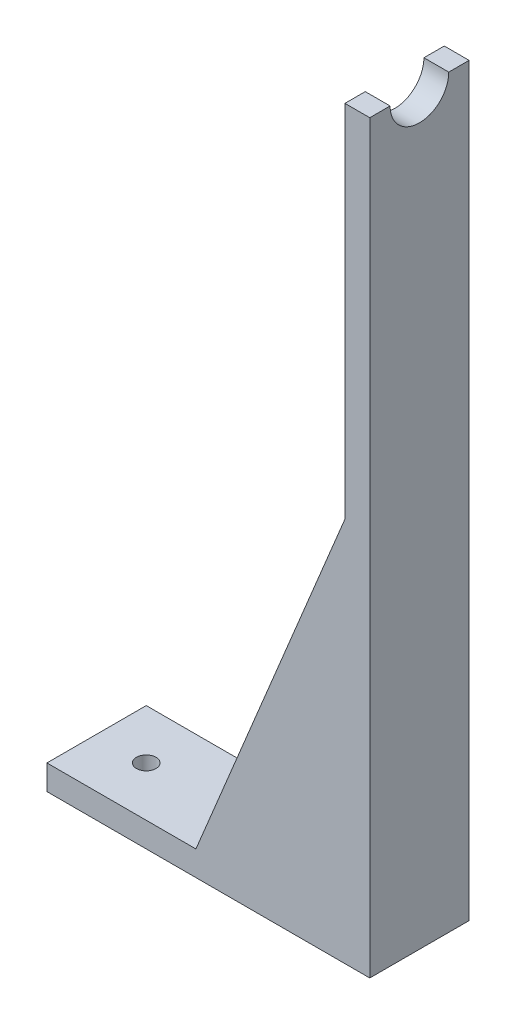
ISO-10303-21;
HEADER;
FILE_DESCRIPTION(('STEP AP214'),'2;1');
FILE_NAME('part.step','',(''),(''),'','','');
FILE_SCHEMA(('AUTOMOTIVE_DESIGN { 1 0 10303 214 1 1 1 1 }'));
ENDSEC;
DATA;
#1=APPLICATION_CONTEXT('core data for automotive mechanical design processes');
#2=APPLICATION_PROTOCOL_DEFINITION('international standard','automotive_design',2000,#1);
#3=PRODUCT_CONTEXT('',#1,'mechanical');
#4=PRODUCT('Part','Part','',(#3));
#5=PRODUCT_RELATED_PRODUCT_CATEGORY('part','',(#4));
#6=PRODUCT_DEFINITION_FORMATION('','',#4);
#7=PRODUCT_DEFINITION_CONTEXT('part definition',#1,'design');
#8=PRODUCT_DEFINITION('design','',#6,#7);
#9=PRODUCT_DEFINITION_SHAPE('','',#8);
#10=(LENGTH_UNIT() NAMED_UNIT(*) SI_UNIT(.MILLI.,.METRE.));
#11=(NAMED_UNIT(*) PLANE_ANGLE_UNIT() SI_UNIT($,.RADIAN.));
#12=(NAMED_UNIT(*) SI_UNIT($,.STERADIAN.) SOLID_ANGLE_UNIT());
#13=UNCERTAINTY_MEASURE_WITH_UNIT(LENGTH_MEASURE(1.E-05),#10,'distance_accuracy_value','');
#14=(GEOMETRIC_REPRESENTATION_CONTEXT(3) GLOBAL_UNCERTAINTY_ASSIGNED_CONTEXT((#13)) GLOBAL_UNIT_ASSIGNED_CONTEXT((#10,
#11,#12)) REPRESENTATION_CONTEXT('',''));
#15=CARTESIAN_POINT('',(0.,0.,0.));
#16=DIRECTION('',(0.,0.,1.));
#17=DIRECTION('',(1.,0.,0.));
#18=AXIS2_PLACEMENT_3D('',#15,#16,#17);
#19=CARTESIAN_POINT('',(44.45,190.5,12.7));
#20=DIRECTION('',(0.,-1.,0.));
#21=DIRECTION('',(0.,0.,-1.));
#22=AXIS2_PLACEMENT_3D('',#19,#20,#21);
#23=PLANE('',#22);
#24=DIRECTION('',(0.,0.,1.));
#25=VECTOR('',#24,1.);
#26=CARTESIAN_POINT('',(38.1,190.5,12.7));
#27=LINE('',#26,#25);
#28=CARTESIAN_POINT('',(38.1,190.5,-12.7));
#29=VERTEX_POINT('',#28);
#30=CARTESIAN_POINT('',(38.1,190.5,-7.50000000000001));
#31=VERTEX_POINT('',#30);
#32=EDGE_CURVE('E142',#29,#31,#27,.T.);
#33=ORIENTED_EDGE('',*,*,#32,.T.);
#34=DIRECTION('',(1.,0.,0.));
#35=VECTOR('',#34,1.);
#36=CARTESIAN_POINT('',(6.85800000000001,190.5,-7.50000000000001));
#37=LINE('',#36,#35);
#38=CARTESIAN_POINT('',(44.45,190.5,-7.50000000000001));
#39=VERTEX_POINT('',#38);
#40=EDGE_CURVE('E131',#31,#39,#37,.T.);
#41=ORIENTED_EDGE('',*,*,#40,.T.);
#42=DIRECTION('',(0.,0.,1.));
#43=VECTOR('',#42,1.);
#44=CARTESIAN_POINT('',(44.45,190.5,12.7));
#45=LINE('',#44,#43);
#46=CARTESIAN_POINT('',(44.45,190.5,-12.7));
#47=VERTEX_POINT('',#46);
#48=EDGE_CURVE('E140',#47,#39,#45,.T.);
#49=ORIENTED_EDGE('',*,*,#48,.F.);
#50=DIRECTION('',(-1.,0.,0.));
#51=VECTOR('',#50,1.);
#52=CARTESIAN_POINT('',(44.45,190.5,-12.7));
#53=LINE('',#52,#51);
#54=EDGE_CURVE('E159',#47,#29,#53,.T.);
#55=ORIENTED_EDGE('',*,*,#54,.T.);
#56=EDGE_LOOP('',(#33,#41,#49,#55));
#57=FACE_BOUND('',#56,.T.);
#58=ADVANCED_FACE('F43',(#57),#23,.F.);
#59=CARTESIAN_POINT('',(-2.24345177664975,0.928324873096448,7.62));
#60=DIRECTION('',(0.924016832421891,-0.3823517927263,0.));
#61=DIRECTION('',(0.3823517927263,0.924016832421891,0.));
#62=AXIS2_PLACEMENT_3D('',#59,#60,#61);
#63=PLANE('',#62);
#64=DIRECTION('',(0.3823517927263,0.924016832421891,0.));
#65=VECTOR('',#64,1.);
#66=CARTESIAN_POINT('',(-2.24345177664975,0.928324873096448,12.7));
#67=LINE('',#66,#65);
#68=CARTESIAN_POINT('',(0.,6.35,12.7));
#69=VERTEX_POINT('',#68);
#70=CARTESIAN_POINT('',(38.1,98.425,12.7));
#71=VERTEX_POINT('',#70);
#72=EDGE_CURVE('E243',#69,#71,#67,.T.);
#73=ORIENTED_EDGE('',*,*,#72,.T.);
#74=DIRECTION('',(0.,0.,1.));
#75=VECTOR('',#74,1.);
#76=CARTESIAN_POINT('',(38.1,98.425,7.62));
#77=LINE('',#76,#75);
#78=CARTESIAN_POINT('',(38.1,98.425,7.62));
#79=VERTEX_POINT('',#78);
#80=EDGE_CURVE('E52',#79,#71,#77,.T.);
#81=ORIENTED_EDGE('',*,*,#80,.F.);
#82=DIRECTION('',(0.3823517927263,0.924016832421891,0.));
#83=VECTOR('',#82,1.);
#84=CARTESIAN_POINT('',(-2.24345177664975,0.928324873096448,7.62));
#85=LINE('',#84,#83);
#86=CARTESIAN_POINT('',(0.,6.35,7.62));
#87=VERTEX_POINT('',#86);
#88=EDGE_CURVE('E247',#87,#79,#85,.T.);
#89=ORIENTED_EDGE('',*,*,#88,.F.);
#90=DIRECTION('',(0.,0.,1.));
#91=VECTOR('',#90,1.);
#92=CARTESIAN_POINT('',(0.,6.35,7.62));
#93=LINE('',#92,#91);
#94=EDGE_CURVE('E66',#87,#69,#93,.T.);
#95=ORIENTED_EDGE('',*,*,#94,.T.);
#96=EDGE_LOOP('',(#73,#81,#89,#95));
#97=FACE_BOUND('',#96,.T.);
#98=ADVANCED_FACE('F45',(#97),#63,.F.);
#99=CARTESIAN_POINT('',(0.,0.,7.62));
#100=DIRECTION('',(0.,0.,1.));
#101=DIRECTION('',(1.,0.,0.));
#102=AXIS2_PLACEMENT_3D('',#99,#100,#101);
#103=PLANE('',#102);
#104=ORIENTED_EDGE('',*,*,#88,.T.);
#105=DIRECTION('',(0.,-1.,0.));
#106=VECTOR('',#105,1.);
#107=CARTESIAN_POINT('',(38.1,0.,7.62));
#108=LINE('',#107,#106);
#109=CARTESIAN_POINT('',(38.1,6.35,7.62));
#110=VERTEX_POINT('',#109);
#111=EDGE_CURVE('E254',#79,#110,#108,.T.);
#112=ORIENTED_EDGE('',*,*,#111,.T.);
#113=DIRECTION('',(-1.,0.,0.));
#114=VECTOR('',#113,1.);
#115=CARTESIAN_POINT('',(0.,6.35,7.62));
#116=LINE('',#115,#114);
#117=EDGE_CURVE('E251',#110,#87,#116,.T.);
#118=ORIENTED_EDGE('',*,*,#117,.T.);
#119=EDGE_LOOP('',(#104,#112,#118));
#120=FACE_BOUND('',#119,.T.);
#121=ADVANCED_FACE('F277',(#120),#103,.F.);
#122=CARTESIAN_POINT('',(0.,0.,12.7));
#123=DIRECTION('',(0.,0.,1.));
#124=DIRECTION('',(1.,0.,0.));
#125=AXIS2_PLACEMENT_3D('',#122,#123,#124);
#126=PLANE('',#125);
#127=ORIENTED_EDGE('',*,*,#72,.F.);
#128=DIRECTION('',(1.,0.,0.));
#129=VECTOR('',#128,1.);
#130=CARTESIAN_POINT('',(38.1,6.35,12.7));
#131=LINE('',#130,#129);
#132=CARTESIAN_POINT('',(-38.1,6.35,12.7));
#133=VERTEX_POINT('',#132);
#134=EDGE_CURVE('E197',#133,#69,#131,.T.);
#135=ORIENTED_EDGE('',*,*,#134,.F.);
#136=DIRECTION('',(0.,-1.,0.));
#137=VECTOR('',#136,1.);
#138=CARTESIAN_POINT('',(-38.1,6.35,12.7));
#139=LINE('',#138,#137);
#140=CARTESIAN_POINT('',(-38.1,0.,12.7));
#141=VERTEX_POINT('',#140);
#142=EDGE_CURVE('E219',#133,#141,#139,.T.);
#143=ORIENTED_EDGE('',*,*,#142,.T.);
#144=DIRECTION('',(1.,0.,0.));
#145=VECTOR('',#144,1.);
#146=CARTESIAN_POINT('',(38.1,0.,12.7));
#147=LINE('',#146,#145);
#148=CARTESIAN_POINT('',(44.45,0.,12.7));
#149=VERTEX_POINT('',#148);
#150=EDGE_CURVE('E211',#141,#149,#147,.T.);
#151=ORIENTED_EDGE('',*,*,#150,.T.);
#152=DIRECTION('',(0.,-1.,0.));
#153=VECTOR('',#152,1.);
#154=CARTESIAN_POINT('',(44.45,0.,12.7));
#155=LINE('',#154,#153);
#156=CARTESIAN_POINT('',(44.45,190.5,12.7));
#157=VERTEX_POINT('',#156);
#158=EDGE_CURVE('E172',#157,#149,#155,.T.);
#159=ORIENTED_EDGE('',*,*,#158,.F.);
#160=DIRECTION('',(-1.,0.,0.));
#161=VECTOR('',#160,1.);
#162=CARTESIAN_POINT('',(44.45,190.5,12.7));
#163=LINE('',#162,#161);
#164=CARTESIAN_POINT('',(38.1,190.5,12.7));
#165=VERTEX_POINT('',#164);
#166=EDGE_CURVE('E153',#157,#165,#163,.T.);
#167=ORIENTED_EDGE('',*,*,#166,.T.);
#168=DIRECTION('',(0.,-1.,0.));
#169=VECTOR('',#168,1.);
#170=CARTESIAN_POINT('',(38.1,0.,12.7));
#171=LINE('',#170,#169);
#172=EDGE_CURVE('E144',#165,#71,#171,.T.);
#173=ORIENTED_EDGE('',*,*,#172,.T.);
#174=EDGE_LOOP('',(#127,#135,#143,#151,#159,#167,#173));
#175=FACE_BOUND('',#174,.T.);
#176=ADVANCED_FACE('F268',(#175),#126,.T.);
#177=CARTESIAN_POINT('',(38.1,0.,0.));
#178=DIRECTION('',(-1.,0.,0.));
#179=DIRECTION('',(0.,0.,1.));
#180=AXIS2_PLACEMENT_3D('',#177,#178,#179);
#181=PLANE('',#180);
#182=CARTESIAN_POINT('',(38.1,190.5,0.));
#183=DIRECTION('',(-1.,0.,0.));
#184=DIRECTION('',(0.,0.,1.));
#185=AXIS2_PLACEMENT_3D('',#182,#183,#184);
#186=CIRCLE('',#185,7.5);
#187=CARTESIAN_POINT('',(38.1,190.5,7.5));
#188=VERTEX_POINT('',#187);
#189=EDGE_CURVE('E145',#31,#188,#186,.T.);
#190=ORIENTED_EDGE('',*,*,#189,.F.);
#191=ORIENTED_EDGE('',*,*,#32,.F.);
#192=DIRECTION('',(0.,1.,0.));
#193=VECTOR('',#192,1.);
#194=CARTESIAN_POINT('',(38.1,0.,-12.7));
#195=LINE('',#194,#193);
#196=CARTESIAN_POINT('',(38.1,98.425,-12.7));
#197=VERTEX_POINT('',#196);
#198=EDGE_CURVE('E167',#197,#29,#195,.T.);
#199=ORIENTED_EDGE('',*,*,#198,.F.);
#200=DIRECTION('',(0.,0.,-1.));
#201=VECTOR('',#200,1.);
#202=CARTESIAN_POINT('',(38.1,98.425,-7.62));
#203=LINE('',#202,#201);
#204=CARTESIAN_POINT('',(38.1,98.425,-7.62));
#205=VERTEX_POINT('',#204);
#206=EDGE_CURVE('E240',#205,#197,#203,.T.);
#207=ORIENTED_EDGE('',*,*,#206,.F.);
#208=DIRECTION('',(0.,-1.,0.));
#209=VECTOR('',#208,1.);
#210=CARTESIAN_POINT('',(38.1,0.,-7.62));
#211=LINE('',#210,#209);
#212=CARTESIAN_POINT('',(38.1,6.35,-7.62));
#213=VERTEX_POINT('',#212);
#214=EDGE_CURVE('E232',#205,#213,#211,.T.);
#215=ORIENTED_EDGE('',*,*,#214,.T.);
#216=DIRECTION('',(0.,0.,-1.));
#217=VECTOR('',#216,1.);
#218=CARTESIAN_POINT('',(38.1,6.35,12.7));
#219=LINE('',#218,#217);
#220=EDGE_CURVE('E201',#110,#213,#219,.T.);
#221=ORIENTED_EDGE('',*,*,#220,.F.);
#222=ORIENTED_EDGE('',*,*,#111,.F.);
#223=ORIENTED_EDGE('',*,*,#80,.T.);
#224=ORIENTED_EDGE('',*,*,#172,.F.);
#225=EDGE_CURVE('E170',#188,#165,#27,.T.);
#226=ORIENTED_EDGE('',*,*,#225,.F.);
#227=EDGE_LOOP('',(#190,#191,#199,#207,#215,#221,#222,#223,#224,#226));
#228=FACE_BOUND('',#227,.T.);
#229=ADVANCED_FACE('F274',(#228),#181,.T.);
#230=CARTESIAN_POINT('',(0.,6.35,0.));
#231=DIRECTION('',(0.,1.,0.));
#232=DIRECTION('',(0.,0.,1.));
#233=AXIS2_PLACEMENT_3D('',#230,#231,#232);
#234=PLANE('',#233);
#235=CARTESIAN_POINT('',(25.4,6.35,0.));
#236=DIRECTION('',(0.,1.,0.));
#237=DIRECTION('',(0.,0.,1.));
#238=AXIS2_PLACEMENT_3D('',#235,#236,#237);
#239=CIRCLE('',#238,2.5);
#240=CARTESIAN_POINT('',(25.4,6.35,2.5));
#241=VERTEX_POINT('',#240);
#242=EDGE_CURVE('E177',#241,#241,#239,.T.);
#243=ORIENTED_EDGE('',*,*,#242,.F.);
#244=EDGE_LOOP('',(#243));
#245=FACE_BOUND('',#244,.T.);
#246=CARTESIAN_POINT('',(-25.4,6.35,0.));
#247=DIRECTION('',(0.,1.,0.));
#248=DIRECTION('',(0.,0.,1.));
#249=AXIS2_PLACEMENT_3D('',#246,#247,#248);
#250=CIRCLE('',#249,2.5);
#251=CARTESIAN_POINT('',(-25.4,6.35,2.5));
#252=VERTEX_POINT('',#251);
#253=EDGE_CURVE('E185',#252,#252,#250,.T.);
#254=ORIENTED_EDGE('',*,*,#253,.F.);
#255=EDGE_LOOP('',(#254));
#256=FACE_BOUND('',#255,.T.);
#257=ORIENTED_EDGE('',*,*,#94,.F.);
#258=ORIENTED_EDGE('',*,*,#117,.F.);
#259=ORIENTED_EDGE('',*,*,#220,.T.);
#260=DIRECTION('',(-1.,0.,0.));
#261=VECTOR('',#260,1.);
#262=CARTESIAN_POINT('',(0.,6.35,-7.62));
#263=LINE('',#262,#261);
#264=CARTESIAN_POINT('',(0.,6.35,-7.62));
#265=VERTEX_POINT('',#264);
#266=EDGE_CURVE('E228',#213,#265,#263,.T.);
#267=ORIENTED_EDGE('',*,*,#266,.T.);
#268=DIRECTION('',(0.,0.,-1.));
#269=VECTOR('',#268,1.);
#270=CARTESIAN_POINT('',(0.,6.35,-7.62));
#271=LINE('',#270,#269);
#272=CARTESIAN_POINT('',(0.,6.35,-12.7));
#273=VERTEX_POINT('',#272);
#274=EDGE_CURVE('E236',#265,#273,#271,.T.);
#275=ORIENTED_EDGE('',*,*,#274,.T.);
#276=DIRECTION('',(-1.,0.,0.));
#277=VECTOR('',#276,1.);
#278=CARTESIAN_POINT('',(38.1,6.35,-12.7));
#279=LINE('',#278,#277);
#280=CARTESIAN_POINT('',(-38.1,6.35,-12.7));
#281=VERTEX_POINT('',#280);
#282=EDGE_CURVE('E204',#273,#281,#279,.T.);
#283=ORIENTED_EDGE('',*,*,#282,.T.);
#284=DIRECTION('',(0.,0.,1.));
#285=VECTOR('',#284,1.);
#286=CARTESIAN_POINT('',(-38.1,6.35,12.7));
#287=LINE('',#286,#285);
#288=EDGE_CURVE('E193',#281,#133,#287,.T.);
#289=ORIENTED_EDGE('',*,*,#288,.T.);
#290=ORIENTED_EDGE('',*,*,#134,.T.);
#291=EDGE_LOOP('',(#257,#258,#259,#267,#275,#283,#289,#290));
#292=FACE_BOUND('',#291,.T.);
#293=ADVANCED_FACE('F278',(#245,#256,#292),#234,.T.);
#294=CARTESIAN_POINT('',(-2.24345177664975,0.928324873096448,-7.62));
#295=DIRECTION('',(0.924016832421891,-0.3823517927263,0.));
#296=DIRECTION('',(0.3823517927263,0.924016832421891,0.));
#297=AXIS2_PLACEMENT_3D('',#294,#295,#296);
#298=PLANE('',#297);
#299=DIRECTION('',(0.3823517927263,0.924016832421891,0.));
#300=VECTOR('',#299,1.);
#301=CARTESIAN_POINT('',(-2.24345177664975,0.928324873096448,-12.7));
#302=LINE('',#301,#300);
#303=EDGE_CURVE('E223',#273,#197,#302,.T.);
#304=ORIENTED_EDGE('',*,*,#303,.F.);
#305=ORIENTED_EDGE('',*,*,#274,.F.);
#306=DIRECTION('',(0.3823517927263,0.924016832421891,0.));
#307=VECTOR('',#306,1.);
#308=CARTESIAN_POINT('',(-2.24345177664975,0.928324873096448,-7.62));
#309=LINE('',#308,#307);
#310=EDGE_CURVE('E224',#265,#205,#309,.T.);
#311=ORIENTED_EDGE('',*,*,#310,.T.);
#312=ORIENTED_EDGE('',*,*,#206,.T.);
#313=EDGE_LOOP('',(#304,#305,#311,#312));
#314=FACE_BOUND('',#313,.T.);
#315=ADVANCED_FACE('F286',(#314),#298,.F.);
#316=CARTESIAN_POINT('',(0.,0.,-7.62));
#317=DIRECTION('',(0.,0.,-1.));
#318=DIRECTION('',(1.,0.,0.));
#319=AXIS2_PLACEMENT_3D('',#316,#317,#318);
#320=PLANE('',#319);
#321=ORIENTED_EDGE('',*,*,#310,.F.);
#322=ORIENTED_EDGE('',*,*,#266,.F.);
#323=ORIENTED_EDGE('',*,*,#214,.F.);
#324=EDGE_LOOP('',(#321,#322,#323));
#325=FACE_BOUND('',#324,.T.);
#326=ADVANCED_FACE('F281',(#325),#320,.F.);
#327=CARTESIAN_POINT('',(0.,0.,-12.7));
#328=DIRECTION('',(0.,0.,-1.));
#329=DIRECTION('',(1.,0.,0.));
#330=AXIS2_PLACEMENT_3D('',#327,#328,#329);
#331=PLANE('',#330);
#332=ORIENTED_EDGE('',*,*,#303,.T.);
#333=ORIENTED_EDGE('',*,*,#198,.T.);
#334=ORIENTED_EDGE('',*,*,#54,.F.);
#335=DIRECTION('',(0.,1.,0.));
#336=VECTOR('',#335,1.);
#337=CARTESIAN_POINT('',(44.45,0.,-12.7));
#338=LINE('',#337,#336);
#339=CARTESIAN_POINT('',(44.45,0.,-12.7));
#340=VERTEX_POINT('',#339);
#341=EDGE_CURVE('E150',#340,#47,#338,.T.);
#342=ORIENTED_EDGE('',*,*,#341,.F.);
#343=DIRECTION('',(-1.,0.,0.));
#344=VECTOR('',#343,1.);
#345=CARTESIAN_POINT('',(38.1,0.,-12.7));
#346=LINE('',#345,#344);
#347=CARTESIAN_POINT('',(-38.1,0.,-12.7));
#348=VERTEX_POINT('',#347);
#349=EDGE_CURVE('E198',#340,#348,#346,.T.);
#350=ORIENTED_EDGE('',*,*,#349,.T.);
#351=DIRECTION('',(0.,-1.,0.));
#352=VECTOR('',#351,1.);
#353=CARTESIAN_POINT('',(-38.1,6.35,-12.7));
#354=LINE('',#353,#352);
#355=EDGE_CURVE('E207',#281,#348,#354,.T.);
#356=ORIENTED_EDGE('',*,*,#355,.F.);
#357=ORIENTED_EDGE('',*,*,#282,.F.);
#358=EDGE_LOOP('',(#332,#333,#334,#342,#350,#356,#357));
#359=FACE_BOUND('',#358,.T.);
#360=ADVANCED_FACE('F289',(#359),#331,.T.);
#361=CARTESIAN_POINT('',(0.,0.,0.));
#362=DIRECTION('',(0.,1.,0.));
#363=DIRECTION('',(0.,0.,1.));
#364=AXIS2_PLACEMENT_3D('',#361,#362,#363);
#365=PLANE('',#364);
#366=DIRECTION('',(0.,0.,1.));
#367=VECTOR('',#366,1.);
#368=CARTESIAN_POINT('',(-38.1,0.,12.7));
#369=LINE('',#368,#367);
#370=EDGE_CURVE('E189',#348,#141,#369,.T.);
#371=ORIENTED_EDGE('',*,*,#370,.F.);
#372=ORIENTED_EDGE('',*,*,#349,.F.);
#373=DIRECTION('',(0.,0.,-1.));
#374=VECTOR('',#373,1.);
#375=CARTESIAN_POINT('',(44.45,0.,12.7));
#376=LINE('',#375,#374);
#377=EDGE_CURVE('E299',#149,#340,#376,.T.);
#378=ORIENTED_EDGE('',*,*,#377,.F.);
#379=ORIENTED_EDGE('',*,*,#150,.F.);
#380=EDGE_LOOP('',(#371,#372,#378,#379));
#381=FACE_BOUND('',#380,.T.);
#382=CARTESIAN_POINT('',(-25.4,0.,0.));
#383=DIRECTION('',(0.,1.,0.));
#384=DIRECTION('',(0.,0.,1.));
#385=AXIS2_PLACEMENT_3D('',#382,#383,#384);
#386=CIRCLE('',#385,2.5);
#387=CARTESIAN_POINT('',(-25.4,0.,2.5));
#388=VERTEX_POINT('',#387);
#389=EDGE_CURVE('E181',#388,#388,#386,.T.);
#390=ORIENTED_EDGE('',*,*,#389,.T.);
#391=EDGE_LOOP('',(#390));
#392=FACE_BOUND('',#391,.T.);
#393=CARTESIAN_POINT('',(25.4,0.,0.));
#394=DIRECTION('',(0.,1.,0.));
#395=DIRECTION('',(0.,0.,1.));
#396=AXIS2_PLACEMENT_3D('',#393,#394,#395);
#397=CIRCLE('',#396,2.5);
#398=CARTESIAN_POINT('',(25.4,0.,2.5));
#399=VERTEX_POINT('',#398);
#400=EDGE_CURVE('E176',#399,#399,#397,.T.);
#401=ORIENTED_EDGE('',*,*,#400,.T.);
#402=EDGE_LOOP('',(#401));
#403=FACE_BOUND('',#402,.T.);
#404=ADVANCED_FACE('F300',(#381,#392,#403),#365,.F.);
#405=CARTESIAN_POINT('',(-38.1,6.35,12.7));
#406=DIRECTION('',(1.,0.,0.));
#407=DIRECTION('',(0.,0.,-1.));
#408=AXIS2_PLACEMENT_3D('',#405,#406,#407);
#409=PLANE('',#408);
#410=ORIENTED_EDGE('',*,*,#370,.T.);
#411=ORIENTED_EDGE('',*,*,#142,.F.);
#412=ORIENTED_EDGE('',*,*,#288,.F.);
#413=ORIENTED_EDGE('',*,*,#355,.T.);
#414=EDGE_LOOP('',(#410,#411,#412,#413));
#415=FACE_BOUND('',#414,.T.);
#416=ADVANCED_FACE('F294',(#415),#409,.F.);
#417=CARTESIAN_POINT('',(-25.4,6.35,0.));
#418=DIRECTION('',(0.,-1.,0.));
#419=DIRECTION('',(0.,0.,-1.));
#420=AXIS2_PLACEMENT_3D('',#417,#418,#419);
#421=CYLINDRICAL_SURFACE('',#420,2.5);
#422=ORIENTED_EDGE('',*,*,#253,.T.);
#423=EDGE_LOOP('',(#422));
#424=FACE_BOUND('',#423,.T.);
#425=ORIENTED_EDGE('',*,*,#389,.F.);
#426=EDGE_LOOP('',(#425));
#427=FACE_BOUND('',#426,.T.);
#428=ADVANCED_FACE('F320',(#424,#427),#421,.F.);
#429=CARTESIAN_POINT('',(25.4,6.35,0.));
#430=DIRECTION('',(0.,-1.,0.));
#431=DIRECTION('',(0.,0.,-1.));
#432=AXIS2_PLACEMENT_3D('',#429,#430,#431);
#433=CYLINDRICAL_SURFACE('',#432,2.5);
#434=ORIENTED_EDGE('',*,*,#242,.T.);
#435=EDGE_LOOP('',(#434));
#436=FACE_BOUND('',#435,.T.);
#437=ORIENTED_EDGE('',*,*,#400,.F.);
#438=EDGE_LOOP('',(#437));
#439=FACE_BOUND('',#438,.T.);
#440=ADVANCED_FACE('F313',(#436,#439),#433,.F.);
#441=CARTESIAN_POINT('',(44.45,190.5,7.5));
#442=VERTEX_POINT('',#441);
#443=EDGE_CURVE('E154',#442,#157,#45,.T.);
#444=ORIENTED_EDGE('',*,*,#443,.F.);
#445=DIRECTION('',(1.,0.,0.));
#446=VECTOR('',#445,1.);
#447=CARTESIAN_POINT('',(6.85800000000001,190.5,7.5));
#448=LINE('',#447,#446);
#449=EDGE_CURVE('E59',#442,#188,#448,.F.);
#450=ORIENTED_EDGE('',*,*,#449,.T.);
#451=ORIENTED_EDGE('',*,*,#225,.T.);
#452=ORIENTED_EDGE('',*,*,#166,.F.);
#453=EDGE_LOOP('',(#444,#450,#451,#452));
#454=FACE_BOUND('',#453,.T.);
#455=ADVANCED_FACE('F310',(#454),#23,.F.);
#456=CARTESIAN_POINT('',(44.45,0.,0.));
#457=DIRECTION('',(-1.,0.,0.));
#458=DIRECTION('',(0.,0.,1.));
#459=AXIS2_PLACEMENT_3D('',#456,#457,#458);
#460=PLANE('',#459);
#461=ORIENTED_EDGE('',*,*,#48,.T.);
#462=CARTESIAN_POINT('',(44.45,190.5,0.));
#463=DIRECTION('',(-1.,0.,0.));
#464=DIRECTION('',(0.,0.,1.));
#465=AXIS2_PLACEMENT_3D('',#462,#463,#464);
#466=CIRCLE('',#465,7.5);
#467=EDGE_CURVE('E11',#39,#442,#466,.T.);
#468=ORIENTED_EDGE('',*,*,#467,.T.);
#469=ORIENTED_EDGE('',*,*,#443,.T.);
#470=ORIENTED_EDGE('',*,*,#158,.T.);
#471=ORIENTED_EDGE('',*,*,#377,.T.);
#472=ORIENTED_EDGE('',*,*,#341,.T.);
#473=EDGE_LOOP('',(#461,#468,#469,#470,#471,#472));
#474=FACE_BOUND('',#473,.T.);
#475=ADVANCED_FACE('F147',(#474),#460,.F.);
#476=CARTESIAN_POINT('',(6.85800000000001,190.5,0.));
#477=DIRECTION('',(1.,0.,0.));
#478=DIRECTION('',(0.,0.,-1.));
#479=AXIS2_PLACEMENT_3D('',#476,#477,#478);
#480=CYLINDRICAL_SURFACE('',#479,7.5);
#481=ORIENTED_EDGE('',*,*,#189,.T.);
#482=ORIENTED_EDGE('',*,*,#449,.F.);
#483=ORIENTED_EDGE('',*,*,#467,.F.);
#484=ORIENTED_EDGE('',*,*,#40,.F.);
#485=EDGE_LOOP('',(#481,#482,#483,#484));
#486=FACE_BOUND('',#485,.T.);
#487=ADVANCED_FACE('F130',(#486),#480,.F.);
#488=CLOSED_SHELL('',(#58,#98,#121,#176,#229,#293,#315,#326,#360,#404,#416,#428,#440,#455,#475,#487));
#489=MANIFOLD_SOLID_BREP('B2',#488);
#490=ADVANCED_BREP_SHAPE_REPRESENTATION('',(#18,#489),#14);
#491=SHAPE_DEFINITION_REPRESENTATION(#9,#490);
ENDSEC;
END-ISO-10303-21;
